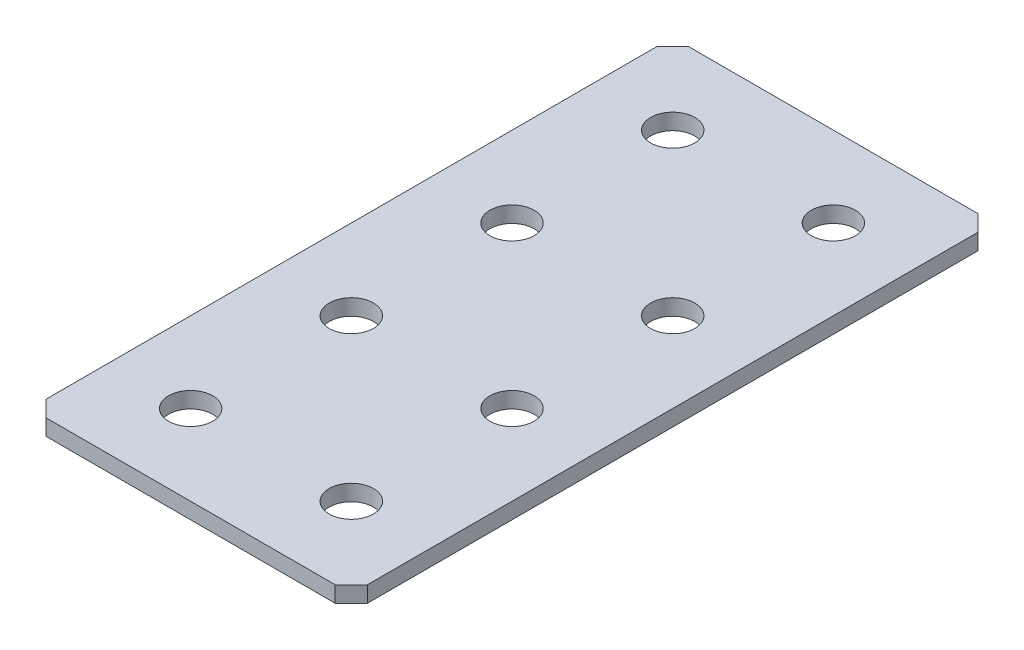
ISO-10303-21;
HEADER;
FILE_DESCRIPTION(('STEP AP214'),'2;1');
FILE_NAME('part.step','',(''),(''),'','','');
FILE_SCHEMA(('AUTOMOTIVE_DESIGN { 1 0 10303 214 1 1 1 1 }'));
ENDSEC;
DATA;
#1=APPLICATION_CONTEXT('core data for automotive mechanical design processes');
#2=APPLICATION_PROTOCOL_DEFINITION('international standard','automotive_design',2000,#1);
#3=PRODUCT_CONTEXT('',#1,'mechanical');
#4=PRODUCT('Part','Part','',(#3));
#5=PRODUCT_RELATED_PRODUCT_CATEGORY('part','',(#4));
#6=PRODUCT_DEFINITION_FORMATION('','',#4);
#7=PRODUCT_DEFINITION_CONTEXT('part definition',#1,'design');
#8=PRODUCT_DEFINITION('design','',#6,#7);
#9=PRODUCT_DEFINITION_SHAPE('','',#8);
#10=(LENGTH_UNIT() NAMED_UNIT(*) SI_UNIT(.MILLI.,.METRE.));
#11=(NAMED_UNIT(*) PLANE_ANGLE_UNIT() SI_UNIT($,.RADIAN.));
#12=(NAMED_UNIT(*) SI_UNIT($,.STERADIAN.) SOLID_ANGLE_UNIT());
#13=UNCERTAINTY_MEASURE_WITH_UNIT(LENGTH_MEASURE(1.E-05),#10,'distance_accuracy_value','');
#14=(GEOMETRIC_REPRESENTATION_CONTEXT(3) GLOBAL_UNCERTAINTY_ASSIGNED_CONTEXT((#13)) GLOBAL_UNIT_ASSIGNED_CONTEXT((#10,
#11,#12)) REPRESENTATION_CONTEXT('',''));
#15=CARTESIAN_POINT('',(0.,0.,0.));
#16=DIRECTION('',(0.,0.,1.));
#17=DIRECTION('',(1.,0.,0.));
#18=AXIS2_PLACEMENT_3D('',#15,#16,#17);
#19=CARTESIAN_POINT('',(20.,2.,40.));
#20=DIRECTION('',(-1.,0.,0.));
#21=DIRECTION('',(0.,0.,1.));
#22=AXIS2_PLACEMENT_3D('',#19,#20,#21);
#23=PLANE('',#22);
#24=DIRECTION('',(0.,0.,-1.));
#25=VECTOR('',#24,1.);
#26=CARTESIAN_POINT('',(20.,2.,40.));
#27=LINE('',#26,#25);
#28=CARTESIAN_POINT('',(20.,2.,38.));
#29=VERTEX_POINT('',#28);
#30=CARTESIAN_POINT('',(20.,2.,-38.));
#31=VERTEX_POINT('',#30);
#32=EDGE_CURVE('E125',#29,#31,#27,.T.);
#33=ORIENTED_EDGE('',*,*,#32,.F.);
#34=DIRECTION('',(0.,-1.,0.));
#35=VECTOR('',#34,1.);
#36=CARTESIAN_POINT('',(20.,2.,38.));
#37=LINE('',#36,#35);
#38=CARTESIAN_POINT('',(20.,0.,38.));
#39=VERTEX_POINT('',#38);
#40=EDGE_CURVE('E151',#29,#39,#37,.T.);
#41=ORIENTED_EDGE('',*,*,#40,.T.);
#42=DIRECTION('',(0.,0.,-1.));
#43=VECTOR('',#42,1.);
#44=CARTESIAN_POINT('',(20.,0.,40.));
#45=LINE('',#44,#43);
#46=CARTESIAN_POINT('',(20.,0.,-38.));
#47=VERTEX_POINT('',#46);
#48=EDGE_CURVE('E159',#39,#47,#45,.T.);
#49=ORIENTED_EDGE('',*,*,#48,.T.);
#50=DIRECTION('',(0.,1.,0.));
#51=VECTOR('',#50,1.);
#52=CARTESIAN_POINT('',(20.,2.,-38.));
#53=LINE('',#52,#51);
#54=EDGE_CURVE('E149',#47,#31,#53,.T.);
#55=ORIENTED_EDGE('',*,*,#54,.T.);
#56=EDGE_LOOP('',(#33,#41,#49,#55));
#57=FACE_BOUND('',#56,.T.);
#58=ADVANCED_FACE('F34',(#57),#23,.F.);
#59=CARTESIAN_POINT('',(-20.,2.,-40.));
#60=DIRECTION('',(0.,0.,1.));
#61=DIRECTION('',(1.,0.,0.));
#62=AXIS2_PLACEMENT_3D('',#59,#60,#61);
#63=PLANE('',#62);
#64=DIRECTION('',(-1.,0.,0.));
#65=VECTOR('',#64,1.);
#66=CARTESIAN_POINT('',(-20.,0.,-40.));
#67=LINE('',#66,#65);
#68=CARTESIAN_POINT('',(18.,0.,-40.));
#69=VERTEX_POINT('',#68);
#70=CARTESIAN_POINT('',(-18.,0.,-40.));
#71=VERTEX_POINT('',#70);
#72=EDGE_CURVE('E130',#69,#71,#67,.T.);
#73=ORIENTED_EDGE('',*,*,#72,.T.);
#74=DIRECTION('',(0.,1.,0.));
#75=VECTOR('',#74,1.);
#76=CARTESIAN_POINT('',(-18.,2.,-40.));
#77=LINE('',#76,#75);
#78=CARTESIAN_POINT('',(-18.,2.,-40.));
#79=VERTEX_POINT('',#78);
#80=EDGE_CURVE('E11',#71,#79,#77,.T.);
#81=ORIENTED_EDGE('',*,*,#80,.T.);
#82=DIRECTION('',(-1.,0.,0.));
#83=VECTOR('',#82,1.);
#84=CARTESIAN_POINT('',(-20.,2.,-40.));
#85=LINE('',#84,#83);
#86=CARTESIAN_POINT('',(18.,2.,-40.));
#87=VERTEX_POINT('',#86);
#88=EDGE_CURVE('E128',#87,#79,#85,.T.);
#89=ORIENTED_EDGE('',*,*,#88,.F.);
#90=DIRECTION('',(0.,-1.,0.));
#91=VECTOR('',#90,1.);
#92=CARTESIAN_POINT('',(18.,2.,-40.));
#93=LINE('',#92,#91);
#94=EDGE_CURVE('E42',#87,#69,#93,.T.);
#95=ORIENTED_EDGE('',*,*,#94,.T.);
#96=EDGE_LOOP('',(#73,#81,#89,#95));
#97=FACE_BOUND('',#96,.T.);
#98=ADVANCED_FACE('F156',(#97),#63,.F.);
#99=CARTESIAN_POINT('',(-20.,2.,40.));
#100=DIRECTION('',(1.,0.,0.));
#101=DIRECTION('',(0.,0.,-1.));
#102=AXIS2_PLACEMENT_3D('',#99,#100,#101);
#103=PLANE('',#102);
#104=DIRECTION('',(0.,0.,1.));
#105=VECTOR('',#104,1.);
#106=CARTESIAN_POINT('',(-20.,0.,40.));
#107=LINE('',#106,#105);
#108=CARTESIAN_POINT('',(-20.,0.,-38.));
#109=VERTEX_POINT('',#108);
#110=CARTESIAN_POINT('',(-20.,0.,38.));
#111=VERTEX_POINT('',#110);
#112=EDGE_CURVE('E126',#109,#111,#107,.T.);
#113=ORIENTED_EDGE('',*,*,#112,.T.);
#114=DIRECTION('',(0.,1.,0.));
#115=VECTOR('',#114,1.);
#116=CARTESIAN_POINT('',(-20.,2.,38.));
#117=LINE('',#116,#115);
#118=CARTESIAN_POINT('',(-20.,2.,38.));
#119=VERTEX_POINT('',#118);
#120=EDGE_CURVE('E104',#111,#119,#117,.T.);
#121=ORIENTED_EDGE('',*,*,#120,.T.);
#122=DIRECTION('',(0.,0.,1.));
#123=VECTOR('',#122,1.);
#124=CARTESIAN_POINT('',(-20.,2.,40.));
#125=LINE('',#124,#123);
#126=CARTESIAN_POINT('',(-20.,2.,-38.));
#127=VERTEX_POINT('',#126);
#128=EDGE_CURVE('E164',#127,#119,#125,.T.);
#129=ORIENTED_EDGE('',*,*,#128,.F.);
#130=DIRECTION('',(0.,-1.,0.));
#131=VECTOR('',#130,1.);
#132=CARTESIAN_POINT('',(-20.,2.,-38.));
#133=LINE('',#132,#131);
#134=EDGE_CURVE('E109',#127,#109,#133,.T.);
#135=ORIENTED_EDGE('',*,*,#134,.T.);
#136=EDGE_LOOP('',(#113,#121,#129,#135));
#137=FACE_BOUND('',#136,.T.);
#138=ADVANCED_FACE('F239',(#137),#103,.F.);
#139=CARTESIAN_POINT('',(-20.,2.,40.));
#140=DIRECTION('',(0.,0.,-1.));
#141=DIRECTION('',(-1.,0.,0.));
#142=AXIS2_PLACEMENT_3D('',#139,#140,#141);
#143=PLANE('',#142);
#144=DIRECTION('',(1.,0.,0.));
#145=VECTOR('',#144,1.);
#146=CARTESIAN_POINT('',(-20.,2.,40.));
#147=LINE('',#146,#145);
#148=CARTESIAN_POINT('',(-18.,2.,40.));
#149=VERTEX_POINT('',#148);
#150=CARTESIAN_POINT('',(18.,2.,40.));
#151=VERTEX_POINT('',#150);
#152=EDGE_CURVE('E119',#149,#151,#147,.T.);
#153=ORIENTED_EDGE('',*,*,#152,.F.);
#154=DIRECTION('',(0.,-1.,0.));
#155=VECTOR('',#154,1.);
#156=CARTESIAN_POINT('',(-18.,2.,40.));
#157=LINE('',#156,#155);
#158=CARTESIAN_POINT('',(-18.,0.,40.));
#159=VERTEX_POINT('',#158);
#160=EDGE_CURVE('E103',#149,#159,#157,.T.);
#161=ORIENTED_EDGE('',*,*,#160,.T.);
#162=DIRECTION('',(1.,0.,0.));
#163=VECTOR('',#162,1.);
#164=CARTESIAN_POINT('',(-20.,0.,40.));
#165=LINE('',#164,#163);
#166=CARTESIAN_POINT('',(18.,0.,40.));
#167=VERTEX_POINT('',#166);
#168=EDGE_CURVE('E116',#159,#167,#165,.T.);
#169=ORIENTED_EDGE('',*,*,#168,.T.);
#170=DIRECTION('',(0.,1.,0.));
#171=VECTOR('',#170,1.);
#172=CARTESIAN_POINT('',(18.,2.,40.));
#173=LINE('',#172,#171);
#174=EDGE_CURVE('E121',#167,#151,#173,.T.);
#175=ORIENTED_EDGE('',*,*,#174,.T.);
#176=EDGE_LOOP('',(#153,#161,#169,#175));
#177=FACE_BOUND('',#176,.T.);
#178=ADVANCED_FACE('F115',(#177),#143,.F.);
#179=CARTESIAN_POINT('',(0.,2.,0.));
#180=DIRECTION('',(0.,-1.,0.));
#181=DIRECTION('',(0.,0.,-1.));
#182=AXIS2_PLACEMENT_3D('',#179,#180,#181);
#183=PLANE('',#182);
#184=CARTESIAN_POINT('',(-10.,2.,-10.));
#185=DIRECTION('',(0.,1.,0.));
#186=DIRECTION('',(0.,0.,1.));
#187=AXIS2_PLACEMENT_3D('',#184,#185,#186);
#188=CIRCLE('',#187,2.75);
#189=CARTESIAN_POINT('',(-10.,2.,-7.25));
#190=VERTEX_POINT('',#189);
#191=EDGE_CURVE('E212',#190,#190,#188,.T.);
#192=ORIENTED_EDGE('',*,*,#191,.F.);
#193=EDGE_LOOP('',(#192));
#194=FACE_BOUND('',#193,.T.);
#195=CARTESIAN_POINT('',(10.,2.,-10.));
#196=DIRECTION('',(0.,1.,0.));
#197=DIRECTION('',(0.,0.,1.));
#198=AXIS2_PLACEMENT_3D('',#195,#196,#197);
#199=CIRCLE('',#198,2.75);
#200=CARTESIAN_POINT('',(10.,2.,-7.25));
#201=VERTEX_POINT('',#200);
#202=EDGE_CURVE('E206',#201,#201,#199,.T.);
#203=ORIENTED_EDGE('',*,*,#202,.F.);
#204=EDGE_LOOP('',(#203));
#205=FACE_BOUND('',#204,.T.);
#206=CARTESIAN_POINT('',(-10.,2.,10.));
#207=DIRECTION('',(0.,1.,0.));
#208=DIRECTION('',(0.,0.,1.));
#209=AXIS2_PLACEMENT_3D('',#206,#207,#208);
#210=CIRCLE('',#209,2.75);
#211=CARTESIAN_POINT('',(-10.,2.,12.75));
#212=VERTEX_POINT('',#211);
#213=EDGE_CURVE('E200',#212,#212,#210,.T.);
#214=ORIENTED_EDGE('',*,*,#213,.F.);
#215=EDGE_LOOP('',(#214));
#216=FACE_BOUND('',#215,.T.);
#217=CARTESIAN_POINT('',(9.99999999999999,2.,10.));
#218=DIRECTION('',(0.,1.,0.));
#219=DIRECTION('',(0.,0.,1.));
#220=AXIS2_PLACEMENT_3D('',#217,#218,#219);
#221=CIRCLE('',#220,2.75);
#222=CARTESIAN_POINT('',(9.99999999999999,2.,12.75));
#223=VERTEX_POINT('',#222);
#224=EDGE_CURVE('E194',#223,#223,#221,.T.);
#225=ORIENTED_EDGE('',*,*,#224,.F.);
#226=EDGE_LOOP('',(#225));
#227=FACE_BOUND('',#226,.T.);
#228=CARTESIAN_POINT('',(-10.,2.,-30.));
#229=DIRECTION('',(0.,1.,0.));
#230=DIRECTION('',(0.,0.,1.));
#231=AXIS2_PLACEMENT_3D('',#228,#229,#230);
#232=CIRCLE('',#231,2.75);
#233=CARTESIAN_POINT('',(-10.,2.,-27.25));
#234=VERTEX_POINT('',#233);
#235=EDGE_CURVE('E188',#234,#234,#232,.T.);
#236=ORIENTED_EDGE('',*,*,#235,.F.);
#237=EDGE_LOOP('',(#236));
#238=FACE_BOUND('',#237,.T.);
#239=CARTESIAN_POINT('',(10.,2.,-30.));
#240=DIRECTION('',(0.,1.,0.));
#241=DIRECTION('',(0.,0.,1.));
#242=AXIS2_PLACEMENT_3D('',#239,#240,#241);
#243=CIRCLE('',#242,2.75);
#244=CARTESIAN_POINT('',(10.,2.,-27.25));
#245=VERTEX_POINT('',#244);
#246=EDGE_CURVE('E182',#245,#245,#243,.T.);
#247=ORIENTED_EDGE('',*,*,#246,.F.);
#248=EDGE_LOOP('',(#247));
#249=FACE_BOUND('',#248,.T.);
#250=CARTESIAN_POINT('',(10.,2.,30.));
#251=DIRECTION('',(0.,1.,0.));
#252=DIRECTION('',(0.,0.,1.));
#253=AXIS2_PLACEMENT_3D('',#250,#251,#252);
#254=CIRCLE('',#253,2.75);
#255=CARTESIAN_POINT('',(10.,2.,32.75));
#256=VERTEX_POINT('',#255);
#257=EDGE_CURVE('E176',#256,#256,#254,.T.);
#258=ORIENTED_EDGE('',*,*,#257,.F.);
#259=EDGE_LOOP('',(#258));
#260=FACE_BOUND('',#259,.T.);
#261=CARTESIAN_POINT('',(-10.,2.,30.));
#262=DIRECTION('',(0.,1.,0.));
#263=DIRECTION('',(0.,0.,1.));
#264=AXIS2_PLACEMENT_3D('',#261,#262,#263);
#265=CIRCLE('',#264,2.75);
#266=CARTESIAN_POINT('',(-10.,2.,32.75));
#267=VERTEX_POINT('',#266);
#268=EDGE_CURVE('E170',#267,#267,#265,.T.);
#269=ORIENTED_EDGE('',*,*,#268,.F.);
#270=EDGE_LOOP('',(#269));
#271=FACE_BOUND('',#270,.T.);
#272=ORIENTED_EDGE('',*,*,#128,.T.);
#273=DIRECTION('',(-0.707106781186545,0.,-0.70710678118655));
#274=VECTOR('',#273,1.);
#275=CARTESIAN_POINT('',(-18.,2.,40.));
#276=LINE('',#275,#274);
#277=EDGE_CURVE('E147',#119,#149,#276,.F.);
#278=ORIENTED_EDGE('',*,*,#277,.T.);
#279=ORIENTED_EDGE('',*,*,#152,.T.);
#280=DIRECTION('',(-0.707106781186552,0.,0.707106781186543));
#281=VECTOR('',#280,1.);
#282=CARTESIAN_POINT('',(20.,2.,38.));
#283=LINE('',#282,#281);
#284=EDGE_CURVE('E145',#151,#29,#283,.F.);
#285=ORIENTED_EDGE('',*,*,#284,.T.);
#286=ORIENTED_EDGE('',*,*,#32,.T.);
#287=DIRECTION('',(0.707106781186546,0.,0.707106781186549));
#288=VECTOR('',#287,1.);
#289=CARTESIAN_POINT('',(18.,2.,-40.));
#290=LINE('',#289,#288);
#291=EDGE_CURVE('E54',#31,#87,#290,.F.);
#292=ORIENTED_EDGE('',*,*,#291,.T.);
#293=ORIENTED_EDGE('',*,*,#88,.T.);
#294=DIRECTION('',(0.707106781186549,0.,-0.707106781186546));
#295=VECTOR('',#294,1.);
#296=CARTESIAN_POINT('',(-20.,2.,-38.));
#297=LINE('',#296,#295);
#298=EDGE_CURVE('E143',#79,#127,#297,.F.);
#299=ORIENTED_EDGE('',*,*,#298,.T.);
#300=EDGE_LOOP('',(#272,#278,#279,#285,#286,#292,#293,#299));
#301=FACE_BOUND('',#300,.T.);
#302=ADVANCED_FACE('F218',(#194,#205,#216,#227,#238,#249,#260,#271,#301),#183,.F.);
#303=CARTESIAN_POINT('',(0.,0.,0.));
#304=DIRECTION('',(0.,-1.,0.));
#305=DIRECTION('',(0.,0.,-1.));
#306=AXIS2_PLACEMENT_3D('',#303,#304,#305);
#307=PLANE('',#306);
#308=CARTESIAN_POINT('',(-10.,0.,-10.));
#309=DIRECTION('',(0.,1.,0.));
#310=DIRECTION('',(0.,0.,1.));
#311=AXIS2_PLACEMENT_3D('',#308,#309,#310);
#312=CIRCLE('',#311,2.75);
#313=CARTESIAN_POINT('',(-10.,0.,-7.25));
#314=VERTEX_POINT('',#313);
#315=EDGE_CURVE('E209',#314,#314,#312,.T.);
#316=ORIENTED_EDGE('',*,*,#315,.T.);
#317=EDGE_LOOP('',(#316));
#318=FACE_BOUND('',#317,.T.);
#319=CARTESIAN_POINT('',(10.,0.,-10.));
#320=DIRECTION('',(0.,1.,0.));
#321=DIRECTION('',(0.,0.,1.));
#322=AXIS2_PLACEMENT_3D('',#319,#320,#321);
#323=CIRCLE('',#322,2.75);
#324=CARTESIAN_POINT('',(10.,0.,-7.25));
#325=VERTEX_POINT('',#324);
#326=EDGE_CURVE('E203',#325,#325,#323,.T.);
#327=ORIENTED_EDGE('',*,*,#326,.T.);
#328=EDGE_LOOP('',(#327));
#329=FACE_BOUND('',#328,.T.);
#330=CARTESIAN_POINT('',(-10.,0.,10.));
#331=DIRECTION('',(0.,1.,0.));
#332=DIRECTION('',(0.,0.,1.));
#333=AXIS2_PLACEMENT_3D('',#330,#331,#332);
#334=CIRCLE('',#333,2.75);
#335=CARTESIAN_POINT('',(-10.,0.,12.75));
#336=VERTEX_POINT('',#335);
#337=EDGE_CURVE('E197',#336,#336,#334,.T.);
#338=ORIENTED_EDGE('',*,*,#337,.T.);
#339=EDGE_LOOP('',(#338));
#340=FACE_BOUND('',#339,.T.);
#341=CARTESIAN_POINT('',(9.99999999999999,0.,10.));
#342=DIRECTION('',(0.,1.,0.));
#343=DIRECTION('',(0.,0.,1.));
#344=AXIS2_PLACEMENT_3D('',#341,#342,#343);
#345=CIRCLE('',#344,2.75);
#346=CARTESIAN_POINT('',(9.99999999999999,0.,12.75));
#347=VERTEX_POINT('',#346);
#348=EDGE_CURVE('E191',#347,#347,#345,.T.);
#349=ORIENTED_EDGE('',*,*,#348,.T.);
#350=EDGE_LOOP('',(#349));
#351=FACE_BOUND('',#350,.T.);
#352=CARTESIAN_POINT('',(-10.,0.,-30.));
#353=DIRECTION('',(0.,1.,0.));
#354=DIRECTION('',(0.,0.,1.));
#355=AXIS2_PLACEMENT_3D('',#352,#353,#354);
#356=CIRCLE('',#355,2.75);
#357=CARTESIAN_POINT('',(-10.,0.,-27.25));
#358=VERTEX_POINT('',#357);
#359=EDGE_CURVE('E185',#358,#358,#356,.T.);
#360=ORIENTED_EDGE('',*,*,#359,.T.);
#361=EDGE_LOOP('',(#360));
#362=FACE_BOUND('',#361,.T.);
#363=CARTESIAN_POINT('',(10.,0.,-30.));
#364=DIRECTION('',(0.,1.,0.));
#365=DIRECTION('',(0.,0.,1.));
#366=AXIS2_PLACEMENT_3D('',#363,#364,#365);
#367=CIRCLE('',#366,2.75);
#368=CARTESIAN_POINT('',(10.,0.,-27.25));
#369=VERTEX_POINT('',#368);
#370=EDGE_CURVE('E179',#369,#369,#367,.T.);
#371=ORIENTED_EDGE('',*,*,#370,.T.);
#372=EDGE_LOOP('',(#371));
#373=FACE_BOUND('',#372,.T.);
#374=CARTESIAN_POINT('',(10.,0.,30.));
#375=DIRECTION('',(0.,1.,0.));
#376=DIRECTION('',(0.,0.,1.));
#377=AXIS2_PLACEMENT_3D('',#374,#375,#376);
#378=CIRCLE('',#377,2.75);
#379=CARTESIAN_POINT('',(10.,0.,32.75));
#380=VERTEX_POINT('',#379);
#381=EDGE_CURVE('E173',#380,#380,#378,.T.);
#382=ORIENTED_EDGE('',*,*,#381,.T.);
#383=EDGE_LOOP('',(#382));
#384=FACE_BOUND('',#383,.T.);
#385=CARTESIAN_POINT('',(-10.,0.,30.));
#386=DIRECTION('',(0.,1.,0.));
#387=DIRECTION('',(0.,0.,1.));
#388=AXIS2_PLACEMENT_3D('',#385,#386,#387);
#389=CIRCLE('',#388,2.75);
#390=CARTESIAN_POINT('',(-10.,0.,32.75));
#391=VERTEX_POINT('',#390);
#392=EDGE_CURVE('E160',#391,#391,#389,.T.);
#393=ORIENTED_EDGE('',*,*,#392,.T.);
#394=EDGE_LOOP('',(#393));
#395=FACE_BOUND('',#394,.T.);
#396=ORIENTED_EDGE('',*,*,#168,.F.);
#397=DIRECTION('',(0.707106781186545,0.,0.70710678118655));
#398=VECTOR('',#397,1.);
#399=CARTESIAN_POINT('',(-29.0000000000001,0.,28.9999999999999));
#400=LINE('',#399,#398);
#401=EDGE_CURVE('E99',#159,#111,#400,.F.);
#402=ORIENTED_EDGE('',*,*,#401,.T.);
#403=ORIENTED_EDGE('',*,*,#112,.F.);
#404=DIRECTION('',(-0.707106781186549,0.,0.707106781186546));
#405=VECTOR('',#404,1.);
#406=CARTESIAN_POINT('',(-29.,0.,-29.0000000000001));
#407=LINE('',#406,#405);
#408=EDGE_CURVE('E136',#109,#71,#407,.F.);
#409=ORIENTED_EDGE('',*,*,#408,.T.);
#410=ORIENTED_EDGE('',*,*,#72,.F.);
#411=DIRECTION('',(-0.707106781186546,0.,-0.707106781186549));
#412=VECTOR('',#411,1.);
#413=CARTESIAN_POINT('',(29.,0.,-28.9999999999999));
#414=LINE('',#413,#412);
#415=EDGE_CURVE('E120',#69,#47,#414,.F.);
#416=ORIENTED_EDGE('',*,*,#415,.T.);
#417=ORIENTED_EDGE('',*,*,#48,.F.);
#418=DIRECTION('',(0.707106781186552,0.,-0.707106781186543));
#419=VECTOR('',#418,1.);
#420=CARTESIAN_POINT('',(28.9999999999999,0.,29.0000000000003));
#421=LINE('',#420,#419);
#422=EDGE_CURVE('E110',#39,#167,#421,.F.);
#423=ORIENTED_EDGE('',*,*,#422,.T.);
#424=EDGE_LOOP('',(#396,#402,#403,#409,#410,#416,#417,#423));
#425=FACE_BOUND('',#424,.T.);
#426=ADVANCED_FACE('F123',(#318,#329,#340,#351,#362,#373,#384,#395,#425),#307,.T.);
#427=CARTESIAN_POINT('',(-18.,2.,40.));
#428=DIRECTION('',(0.70710678118655,0.,-0.707106781186545));
#429=DIRECTION('',(0.,-1.,0.));
#430=AXIS2_PLACEMENT_3D('',#427,#428,#429);
#431=PLANE('',#430);
#432=ORIENTED_EDGE('',*,*,#277,.F.);
#433=ORIENTED_EDGE('',*,*,#120,.F.);
#434=ORIENTED_EDGE('',*,*,#401,.F.);
#435=ORIENTED_EDGE('',*,*,#160,.F.);
#436=EDGE_LOOP('',(#432,#433,#434,#435));
#437=FACE_BOUND('',#436,.T.);
#438=ADVANCED_FACE('F102',(#437),#431,.F.);
#439=CARTESIAN_POINT('',(20.,2.,38.));
#440=DIRECTION('',(-0.707106781186543,0.,-0.707106781186552));
#441=DIRECTION('',(0.,-1.,0.));
#442=AXIS2_PLACEMENT_3D('',#439,#440,#441);
#443=PLANE('',#442);
#444=ORIENTED_EDGE('',*,*,#284,.F.);
#445=ORIENTED_EDGE('',*,*,#174,.F.);
#446=ORIENTED_EDGE('',*,*,#422,.F.);
#447=ORIENTED_EDGE('',*,*,#40,.F.);
#448=EDGE_LOOP('',(#444,#445,#446,#447));
#449=FACE_BOUND('',#448,.T.);
#450=ADVANCED_FACE('F243',(#449),#443,.F.);
#451=CARTESIAN_POINT('',(-20.,2.,-38.));
#452=DIRECTION('',(0.707106781186546,0.,0.707106781186549));
#453=DIRECTION('',(0.,-1.,0.));
#454=AXIS2_PLACEMENT_3D('',#451,#452,#453);
#455=PLANE('',#454);
#456=ORIENTED_EDGE('',*,*,#298,.F.);
#457=ORIENTED_EDGE('',*,*,#80,.F.);
#458=ORIENTED_EDGE('',*,*,#408,.F.);
#459=ORIENTED_EDGE('',*,*,#134,.F.);
#460=EDGE_LOOP('',(#456,#457,#458,#459));
#461=FACE_BOUND('',#460,.T.);
#462=ADVANCED_FACE('F241',(#461),#455,.F.);
#463=CARTESIAN_POINT('',(18.,2.,-40.));
#464=DIRECTION('',(-0.707106781186549,0.,0.707106781186546));
#465=DIRECTION('',(0.,-1.,0.));
#466=AXIS2_PLACEMENT_3D('',#463,#464,#465);
#467=PLANE('',#466);
#468=ORIENTED_EDGE('',*,*,#291,.F.);
#469=ORIENTED_EDGE('',*,*,#54,.F.);
#470=ORIENTED_EDGE('',*,*,#415,.F.);
#471=ORIENTED_EDGE('',*,*,#94,.F.);
#472=EDGE_LOOP('',(#468,#469,#470,#471));
#473=FACE_BOUND('',#472,.T.);
#474=ADVANCED_FACE('F36',(#473),#467,.F.);
#475=CARTESIAN_POINT('',(-10.,2.,30.));
#476=DIRECTION('',(0.,1.,0.));
#477=DIRECTION('',(0.,0.,1.));
#478=AXIS2_PLACEMENT_3D('',#475,#476,#477);
#479=CYLINDRICAL_SURFACE('',#478,2.75);
#480=ORIENTED_EDGE('',*,*,#392,.F.);
#481=EDGE_LOOP('',(#480));
#482=FACE_BOUND('',#481,.T.);
#483=ORIENTED_EDGE('',*,*,#268,.T.);
#484=EDGE_LOOP('',(#483));
#485=FACE_BOUND('',#484,.T.);
#486=ADVANCED_FACE('F248',(#482,#485),#479,.F.);
#487=CARTESIAN_POINT('',(10.,2.,30.));
#488=DIRECTION('',(0.,1.,0.));
#489=DIRECTION('',(0.,0.,1.));
#490=AXIS2_PLACEMENT_3D('',#487,#488,#489);
#491=CYLINDRICAL_SURFACE('',#490,2.75);
#492=ORIENTED_EDGE('',*,*,#381,.F.);
#493=EDGE_LOOP('',(#492));
#494=FACE_BOUND('',#493,.T.);
#495=ORIENTED_EDGE('',*,*,#257,.T.);
#496=EDGE_LOOP('',(#495));
#497=FACE_BOUND('',#496,.T.);
#498=ADVANCED_FACE('F303',(#494,#497),#491,.F.);
#499=CARTESIAN_POINT('',(10.,2.,-30.));
#500=DIRECTION('',(0.,1.,0.));
#501=DIRECTION('',(0.,0.,1.));
#502=AXIS2_PLACEMENT_3D('',#499,#500,#501);
#503=CYLINDRICAL_SURFACE('',#502,2.75);
#504=ORIENTED_EDGE('',*,*,#370,.F.);
#505=EDGE_LOOP('',(#504));
#506=FACE_BOUND('',#505,.T.);
#507=ORIENTED_EDGE('',*,*,#246,.T.);
#508=EDGE_LOOP('',(#507));
#509=FACE_BOUND('',#508,.T.);
#510=ADVANCED_FACE('F312',(#506,#509),#503,.F.);
#511=CARTESIAN_POINT('',(-10.,2.,-30.));
#512=DIRECTION('',(0.,1.,0.));
#513=DIRECTION('',(0.,0.,1.));
#514=AXIS2_PLACEMENT_3D('',#511,#512,#513);
#515=CYLINDRICAL_SURFACE('',#514,2.75);
#516=ORIENTED_EDGE('',*,*,#359,.F.);
#517=EDGE_LOOP('',(#516));
#518=FACE_BOUND('',#517,.T.);
#519=ORIENTED_EDGE('',*,*,#235,.T.);
#520=EDGE_LOOP('',(#519));
#521=FACE_BOUND('',#520,.T.);
#522=ADVANCED_FACE('F322',(#518,#521),#515,.F.);
#523=CARTESIAN_POINT('',(9.99999999999999,2.,10.));
#524=DIRECTION('',(0.,1.,0.));
#525=DIRECTION('',(0.,0.,1.));
#526=AXIS2_PLACEMENT_3D('',#523,#524,#525);
#527=CYLINDRICAL_SURFACE('',#526,2.75);
#528=ORIENTED_EDGE('',*,*,#348,.F.);
#529=EDGE_LOOP('',(#528));
#530=FACE_BOUND('',#529,.T.);
#531=ORIENTED_EDGE('',*,*,#224,.T.);
#532=EDGE_LOOP('',(#531));
#533=FACE_BOUND('',#532,.T.);
#534=ADVANCED_FACE('F332',(#530,#533),#527,.F.);
#535=CARTESIAN_POINT('',(-10.,2.,10.));
#536=DIRECTION('',(0.,1.,0.));
#537=DIRECTION('',(0.,0.,1.));
#538=AXIS2_PLACEMENT_3D('',#535,#536,#537);
#539=CYLINDRICAL_SURFACE('',#538,2.75);
#540=ORIENTED_EDGE('',*,*,#337,.F.);
#541=EDGE_LOOP('',(#540));
#542=FACE_BOUND('',#541,.T.);
#543=ORIENTED_EDGE('',*,*,#213,.T.);
#544=EDGE_LOOP('',(#543));
#545=FACE_BOUND('',#544,.T.);
#546=ADVANCED_FACE('F342',(#542,#545),#539,.F.);
#547=CARTESIAN_POINT('',(10.,2.,-10.));
#548=DIRECTION('',(0.,1.,0.));
#549=DIRECTION('',(0.,0.,1.));
#550=AXIS2_PLACEMENT_3D('',#547,#548,#549);
#551=CYLINDRICAL_SURFACE('',#550,2.75);
#552=ORIENTED_EDGE('',*,*,#326,.F.);
#553=EDGE_LOOP('',(#552));
#554=FACE_BOUND('',#553,.T.);
#555=ORIENTED_EDGE('',*,*,#202,.T.);
#556=EDGE_LOOP('',(#555));
#557=FACE_BOUND('',#556,.T.);
#558=ADVANCED_FACE('F352',(#554,#557),#551,.F.);
#559=CARTESIAN_POINT('',(-10.,2.,-10.));
#560=DIRECTION('',(0.,1.,0.));
#561=DIRECTION('',(0.,0.,1.));
#562=AXIS2_PLACEMENT_3D('',#559,#560,#561);
#563=CYLINDRICAL_SURFACE('',#562,2.75);
#564=ORIENTED_EDGE('',*,*,#315,.F.);
#565=EDGE_LOOP('',(#564));
#566=FACE_BOUND('',#565,.T.);
#567=ORIENTED_EDGE('',*,*,#191,.T.);
#568=EDGE_LOOP('',(#567));
#569=FACE_BOUND('',#568,.T.);
#570=ADVANCED_FACE('F216',(#566,#569),#563,.F.);
#571=CLOSED_SHELL('',(#58,#98,#138,#178,#302,#426,#438,#450,#462,#474,#486,#498,#510,#522,#534,
#546,#558,#570));
#572=MANIFOLD_SOLID_BREP('B2',#571);
#573=ADVANCED_BREP_SHAPE_REPRESENTATION('',(#18,#572),#14);
#574=SHAPE_DEFINITION_REPRESENTATION(#9,#573);
ENDSEC;
END-ISO-10303-21;
